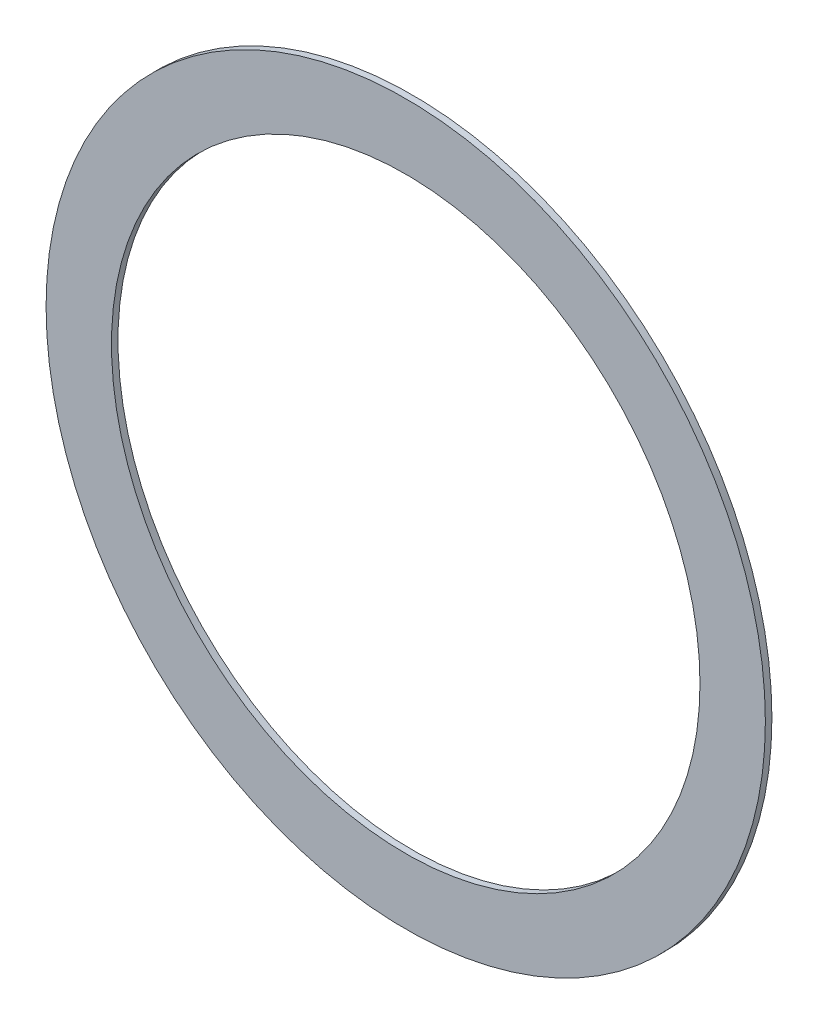
ISO-10303-21;
HEADER;
FILE_DESCRIPTION(('STEP AP214'),'2;1');
FILE_NAME('part.step','',(''),(''),'','','');
FILE_SCHEMA(('AUTOMOTIVE_DESIGN { 1 0 10303 214 1 1 1 1 }'));
ENDSEC;
DATA;
#1=APPLICATION_CONTEXT('core data for automotive mechanical design processes');
#2=APPLICATION_PROTOCOL_DEFINITION('international standard','automotive_design',2000,#1);
#3=PRODUCT_CONTEXT('',#1,'mechanical');
#4=PRODUCT('Part','Part','',(#3));
#5=PRODUCT_RELATED_PRODUCT_CATEGORY('part','',(#4));
#6=PRODUCT_DEFINITION_FORMATION('','',#4);
#7=PRODUCT_DEFINITION_CONTEXT('part definition',#1,'design');
#8=PRODUCT_DEFINITION('design','',#6,#7);
#9=PRODUCT_DEFINITION_SHAPE('','',#8);
#10=(LENGTH_UNIT() NAMED_UNIT(*) SI_UNIT(.MILLI.,.METRE.));
#11=(NAMED_UNIT(*) PLANE_ANGLE_UNIT() SI_UNIT($,.RADIAN.));
#12=(NAMED_UNIT(*) SI_UNIT($,.STERADIAN.) SOLID_ANGLE_UNIT());
#13=UNCERTAINTY_MEASURE_WITH_UNIT(LENGTH_MEASURE(1.E-05),#10,'distance_accuracy_value','');
#14=(GEOMETRIC_REPRESENTATION_CONTEXT(3) GLOBAL_UNCERTAINTY_ASSIGNED_CONTEXT((#13)) GLOBAL_UNIT_ASSIGNED_CONTEXT((#10,
#11,#12)) REPRESENTATION_CONTEXT('',''));
#15=CARTESIAN_POINT('',(0.,0.,0.));
#16=DIRECTION('',(0.,0.,1.));
#17=DIRECTION('',(1.,0.,0.));
#18=AXIS2_PLACEMENT_3D('',#15,#16,#17);
#19=CARTESIAN_POINT('',(0.,0.,0.05));
#20=DIRECTION('',(0.,0.,1.));
#21=DIRECTION('',(1.,0.,0.));
#22=AXIS2_PLACEMENT_3D('',#19,#20,#21);
#23=PLANE('',#22);
#24=CARTESIAN_POINT('',(0.,0.,0.05));
#25=DIRECTION('',(0.,0.,1.));
#26=DIRECTION('',(1.,0.,0.));
#27=AXIS2_PLACEMENT_3D('',#24,#25,#26);
#28=CIRCLE('',#27,2.75);
#29=CARTESIAN_POINT('',(2.75,0.,0.05));
#30=VERTEX_POINT('',#29);
#31=EDGE_CURVE('E10',#30,#30,#28,.T.);
#32=ORIENTED_EDGE('',*,*,#31,.T.);
#33=EDGE_LOOP('',(#32));
#34=FACE_BOUND('',#33,.T.);
#35=CARTESIAN_POINT('',(0.,0.,0.05));
#36=DIRECTION('',(0.,0.,1.));
#37=DIRECTION('',(1.,0.,0.));
#38=AXIS2_PLACEMENT_3D('',#35,#36,#37);
#39=CIRCLE('',#38,2.25);
#40=CARTESIAN_POINT('',(2.25,0.,0.05));
#41=VERTEX_POINT('',#40);
#42=EDGE_CURVE('E46',#41,#41,#39,.T.);
#43=ORIENTED_EDGE('',*,*,#42,.F.);
#44=EDGE_LOOP('',(#43));
#45=FACE_BOUND('',#44,.T.);
#46=ADVANCED_FACE('F35',(#34,#45),#23,.T.);
#47=CARTESIAN_POINT('',(0.,0.,0.));
#48=DIRECTION('',(0.,0.,1.));
#49=DIRECTION('',(1.,0.,0.));
#50=AXIS2_PLACEMENT_3D('',#47,#48,#49);
#51=PLANE('',#50);
#52=CARTESIAN_POINT('',(0.,0.,0.));
#53=DIRECTION('',(0.,0.,1.));
#54=DIRECTION('',(1.,0.,0.));
#55=AXIS2_PLACEMENT_3D('',#52,#53,#54);
#56=CIRCLE('',#55,2.75);
#57=CARTESIAN_POINT('',(2.75,0.,0.));
#58=VERTEX_POINT('',#57);
#59=EDGE_CURVE('E39',#58,#58,#56,.T.);
#60=ORIENTED_EDGE('',*,*,#59,.F.);
#61=EDGE_LOOP('',(#60));
#62=FACE_BOUND('',#61,.T.);
#63=CARTESIAN_POINT('',(0.,0.,0.));
#64=DIRECTION('',(0.,0.,1.));
#65=DIRECTION('',(1.,0.,0.));
#66=AXIS2_PLACEMENT_3D('',#63,#64,#65);
#67=CIRCLE('',#66,2.25);
#68=CARTESIAN_POINT('',(2.25,0.,0.));
#69=VERTEX_POINT('',#68);
#70=EDGE_CURVE('E48',#69,#69,#67,.T.);
#71=ORIENTED_EDGE('',*,*,#70,.T.);
#72=EDGE_LOOP('',(#71));
#73=FACE_BOUND('',#72,.T.);
#74=ADVANCED_FACE('F58',(#62,#73),#51,.F.);
#75=CARTESIAN_POINT('',(0.,0.,0.05));
#76=DIRECTION('',(0.,0.,-1.));
#77=DIRECTION('',(-1.,0.,0.));
#78=AXIS2_PLACEMENT_3D('',#75,#76,#77);
#79=CYLINDRICAL_SURFACE('',#78,2.75);
#80=ORIENTED_EDGE('',*,*,#31,.F.);
#81=EDGE_LOOP('',(#80));
#82=FACE_BOUND('',#81,.T.);
#83=ORIENTED_EDGE('',*,*,#59,.T.);
#84=EDGE_LOOP('',(#83));
#85=FACE_BOUND('',#84,.T.);
#86=ADVANCED_FACE('F37',(#82,#85),#79,.T.);
#87=CARTESIAN_POINT('',(0.,0.,0.05));
#88=DIRECTION('',(0.,0.,-1.));
#89=DIRECTION('',(-1.,0.,0.));
#90=AXIS2_PLACEMENT_3D('',#87,#88,#89);
#91=CYLINDRICAL_SURFACE('',#90,2.25);
#92=ORIENTED_EDGE('',*,*,#42,.T.);
#93=EDGE_LOOP('',(#92));
#94=FACE_BOUND('',#93,.T.);
#95=ORIENTED_EDGE('',*,*,#70,.F.);
#96=EDGE_LOOP('',(#95));
#97=FACE_BOUND('',#96,.T.);
#98=ADVANCED_FACE('F54',(#94,#97),#91,.F.);
#99=CLOSED_SHELL('',(#46,#74,#86,#98));
#100=MANIFOLD_SOLID_BREP('B2',#99);
#101=ADVANCED_BREP_SHAPE_REPRESENTATION('',(#18,#100),#14);
#102=SHAPE_DEFINITION_REPRESENTATION(#9,#101);
ENDSEC;
END-ISO-10303-21;
